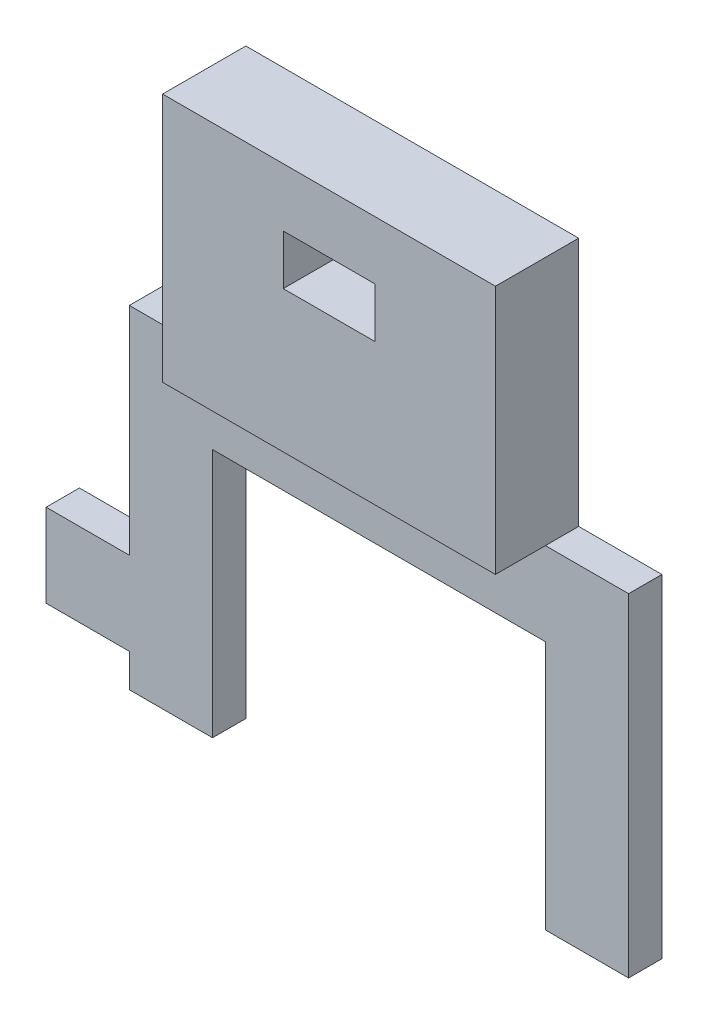
ISO-10303-21;
HEADER;
FILE_DESCRIPTION(('STEP AP214'),'2;1');
FILE_NAME('part.step','',(''),(''),'','','');
FILE_SCHEMA(('AUTOMOTIVE_DESIGN { 1 0 10303 214 1 1 1 1 }'));
ENDSEC;
DATA;
#1=APPLICATION_CONTEXT('core data for automotive mechanical design processes');
#2=APPLICATION_PROTOCOL_DEFINITION('international standard','automotive_design',2000,#1);
#3=PRODUCT_CONTEXT('',#1,'mechanical');
#4=PRODUCT('Part','Part','',(#3));
#5=PRODUCT_RELATED_PRODUCT_CATEGORY('part','',(#4));
#6=PRODUCT_DEFINITION_FORMATION('','',#4);
#7=PRODUCT_DEFINITION_CONTEXT('part definition',#1,'design');
#8=PRODUCT_DEFINITION('design','',#6,#7);
#9=PRODUCT_DEFINITION_SHAPE('','',#8);
#10=(LENGTH_UNIT() NAMED_UNIT(*) SI_UNIT(.MILLI.,.METRE.));
#11=(NAMED_UNIT(*) PLANE_ANGLE_UNIT() SI_UNIT($,.RADIAN.));
#12=(NAMED_UNIT(*) SI_UNIT($,.STERADIAN.) SOLID_ANGLE_UNIT());
#13=UNCERTAINTY_MEASURE_WITH_UNIT(LENGTH_MEASURE(1.E-05),#10,'distance_accuracy_value','');
#14=(GEOMETRIC_REPRESENTATION_CONTEXT(3) GLOBAL_UNCERTAINTY_ASSIGNED_CONTEXT((#13)) GLOBAL_UNIT_ASSIGNED_CONTEXT((#10,
#11,#12)) REPRESENTATION_CONTEXT('',''));
#15=CARTESIAN_POINT('',(0.,0.,0.));
#16=DIRECTION('',(0.,0.,1.));
#17=DIRECTION('',(1.,0.,0.));
#18=AXIS2_PLACEMENT_3D('',#15,#16,#17);
#19=CARTESIAN_POINT('',(35.,18.,2.));
#20=DIRECTION('',(0.,-1.,0.));
#21=DIRECTION('',(1.,0.,0.));
#22=AXIS2_PLACEMENT_3D('',#19,#20,#21);
#23=PLANE('',#22);
#24=DIRECTION('',(0.,0.,1.));
#25=VECTOR('',#24,1.);
#26=CARTESIAN_POINT('',(10.,18.,0.));
#27=LINE('',#26,#25);
#28=CARTESIAN_POINT('',(10.,18.,0.));
#29=VERTEX_POINT('',#28);
#30=CARTESIAN_POINT('',(10.,18.,2.));
#31=VERTEX_POINT('',#30);
#32=EDGE_CURVE('E185',#29,#31,#27,.T.);
#33=ORIENTED_EDGE('',*,*,#32,.F.);
#34=DIRECTION('',(-1.,0.,0.));
#35=VECTOR('',#34,1.);
#36=CARTESIAN_POINT('',(35.,18.,0.));
#37=LINE('',#36,#35);
#38=CARTESIAN_POINT('',(5.,18.,0.));
#39=VERTEX_POINT('',#38);
#40=EDGE_CURVE('E289',#29,#39,#37,.T.);
#41=ORIENTED_EDGE('',*,*,#40,.T.);
#42=DIRECTION('',(0.,0.,-1.));
#43=VECTOR('',#42,1.);
#44=CARTESIAN_POINT('',(5.,18.,2.));
#45=LINE('',#44,#43);
#46=CARTESIAN_POINT('',(5.,18.,2.));
#47=VERTEX_POINT('',#46);
#48=EDGE_CURVE('E300',#47,#39,#45,.T.);
#49=ORIENTED_EDGE('',*,*,#48,.F.);
#50=DIRECTION('',(-1.,0.,0.));
#51=VECTOR('',#50,1.);
#52=CARTESIAN_POINT('',(35.,18.,2.));
#53=LINE('',#52,#51);
#54=EDGE_CURVE('E262',#31,#47,#53,.T.);
#55=ORIENTED_EDGE('',*,*,#54,.F.);
#56=EDGE_LOOP('',(#33,#41,#49,#55));
#57=FACE_BOUND('',#56,.T.);
#58=ADVANCED_FACE('F33',(#57),#23,.F.);
#59=DIRECTION('',(0.,0.,-1.));
#60=VECTOR('',#59,1.);
#61=CARTESIAN_POINT('',(30.,18.,0.));
#62=LINE('',#61,#60);
#63=CARTESIAN_POINT('',(30.,18.,2.));
#64=VERTEX_POINT('',#63);
#65=CARTESIAN_POINT('',(30.,18.,0.));
#66=VERTEX_POINT('',#65);
#67=EDGE_CURVE('E227',#64,#66,#62,.T.);
#68=ORIENTED_EDGE('',*,*,#67,.F.);
#69=CARTESIAN_POINT('',(35.,18.,2.));
#70=VERTEX_POINT('',#69);
#71=EDGE_CURVE('E263',#70,#64,#53,.T.);
#72=ORIENTED_EDGE('',*,*,#71,.F.);
#73=DIRECTION('',(0.,0.,-1.));
#74=VECTOR('',#73,1.);
#75=CARTESIAN_POINT('',(35.,18.,2.));
#76=LINE('',#75,#74);
#77=CARTESIAN_POINT('',(35.,18.,0.));
#78=VERTEX_POINT('',#77);
#79=EDGE_CURVE('E303',#70,#78,#76,.T.);
#80=ORIENTED_EDGE('',*,*,#79,.T.);
#81=EDGE_CURVE('E290',#78,#66,#37,.T.);
#82=ORIENTED_EDGE('',*,*,#81,.T.);
#83=EDGE_LOOP('',(#68,#72,#80,#82));
#84=FACE_BOUND('',#83,.T.);
#85=ADVANCED_FACE('F353',(#84),#23,.F.);
#86=CARTESIAN_POINT('',(0.,5.,2.));
#87=DIRECTION('',(1.,0.,0.));
#88=DIRECTION('',(0.,0.,-1.));
#89=AXIS2_PLACEMENT_3D('',#86,#87,#88);
#90=PLANE('',#89);
#91=DIRECTION('',(0.,-1.,0.));
#92=VECTOR('',#91,1.);
#93=CARTESIAN_POINT('',(0.,5.,0.));
#94=LINE('',#93,#92);
#95=CARTESIAN_POINT('',(0.,5.,0.));
#96=VERTEX_POINT('',#95);
#97=CARTESIAN_POINT('',(0.,0.,0.));
#98=VERTEX_POINT('',#97);
#99=EDGE_CURVE('E241',#96,#98,#94,.T.);
#100=ORIENTED_EDGE('',*,*,#99,.T.);
#101=DIRECTION('',(0.,0.,-1.));
#102=VECTOR('',#101,1.);
#103=CARTESIAN_POINT('',(0.,0.,2.));
#104=LINE('',#103,#102);
#105=CARTESIAN_POINT('',(0.,0.,2.));
#106=VERTEX_POINT('',#105);
#107=EDGE_CURVE('E327',#106,#98,#104,.T.);
#108=ORIENTED_EDGE('',*,*,#107,.F.);
#109=DIRECTION('',(0.,-1.,0.));
#110=VECTOR('',#109,1.);
#111=CARTESIAN_POINT('',(0.,5.,2.));
#112=LINE('',#111,#110);
#113=CARTESIAN_POINT('',(0.,5.,2.));
#114=VERTEX_POINT('',#113);
#115=EDGE_CURVE('E242',#114,#106,#112,.T.);
#116=ORIENTED_EDGE('',*,*,#115,.F.);
#117=DIRECTION('',(0.,0.,-1.));
#118=VECTOR('',#117,1.);
#119=CARTESIAN_POINT('',(0.,5.,2.));
#120=LINE('',#119,#118);
#121=EDGE_CURVE('E269',#114,#96,#120,.T.);
#122=ORIENTED_EDGE('',*,*,#121,.T.);
#123=EDGE_LOOP('',(#100,#108,#116,#122));
#124=FACE_BOUND('',#123,.T.);
#125=ADVANCED_FACE('F35',(#124),#90,.F.);
#126=CARTESIAN_POINT('',(0.,0.,2.));
#127=DIRECTION('',(0.,1.,0.));
#128=DIRECTION('',(-1.,0.,0.));
#129=AXIS2_PLACEMENT_3D('',#126,#127,#128);
#130=PLANE('',#129);
#131=DIRECTION('',(1.,0.,0.));
#132=VECTOR('',#131,1.);
#133=CARTESIAN_POINT('',(0.,0.,0.));
#134=LINE('',#133,#132);
#135=CARTESIAN_POINT('',(5.,0.,0.));
#136=VERTEX_POINT('',#135);
#137=EDGE_CURVE('E272',#98,#136,#134,.T.);
#138=ORIENTED_EDGE('',*,*,#137,.T.);
#139=DIRECTION('',(0.,0.,-1.));
#140=VECTOR('',#139,1.);
#141=CARTESIAN_POINT('',(5.,0.,2.));
#142=LINE('',#141,#140);
#143=CARTESIAN_POINT('',(5.,0.,2.));
#144=VERTEX_POINT('',#143);
#145=EDGE_CURVE('E324',#144,#136,#142,.T.);
#146=ORIENTED_EDGE('',*,*,#145,.F.);
#147=DIRECTION('',(1.,0.,0.));
#148=VECTOR('',#147,1.);
#149=CARTESIAN_POINT('',(0.,0.,2.));
#150=LINE('',#149,#148);
#151=EDGE_CURVE('E245',#106,#144,#150,.T.);
#152=ORIENTED_EDGE('',*,*,#151,.F.);
#153=ORIENTED_EDGE('',*,*,#107,.T.);
#154=EDGE_LOOP('',(#138,#146,#152,#153));
#155=FACE_BOUND('',#154,.T.);
#156=ADVANCED_FACE('F392',(#155),#130,.F.);
#157=CARTESIAN_POINT('',(5.,0.,2.));
#158=DIRECTION('',(1.,0.,0.));
#159=DIRECTION('',(0.,0.,-1.));
#160=AXIS2_PLACEMENT_3D('',#157,#158,#159);
#161=PLANE('',#160);
#162=DIRECTION('',(0.,-1.,0.));
#163=VECTOR('',#162,1.);
#164=CARTESIAN_POINT('',(5.,0.,0.));
#165=LINE('',#164,#163);
#166=CARTESIAN_POINT('',(5.,-2.,0.));
#167=VERTEX_POINT('',#166);
#168=EDGE_CURVE('E274',#136,#167,#165,.T.);
#169=ORIENTED_EDGE('',*,*,#168,.T.);
#170=DIRECTION('',(0.,0.,-1.));
#171=VECTOR('',#170,1.);
#172=CARTESIAN_POINT('',(5.,-2.,2.));
#173=LINE('',#172,#171);
#174=CARTESIAN_POINT('',(5.,-2.,2.));
#175=VERTEX_POINT('',#174);
#176=EDGE_CURVE('E321',#175,#167,#173,.T.);
#177=ORIENTED_EDGE('',*,*,#176,.F.);
#178=DIRECTION('',(0.,-1.,0.));
#179=VECTOR('',#178,1.);
#180=CARTESIAN_POINT('',(5.,0.,2.));
#181=LINE('',#180,#179);
#182=EDGE_CURVE('E248',#144,#175,#181,.T.);
#183=ORIENTED_EDGE('',*,*,#182,.F.);
#184=ORIENTED_EDGE('',*,*,#145,.T.);
#185=EDGE_LOOP('',(#169,#177,#183,#184));
#186=FACE_BOUND('',#185,.T.);
#187=ADVANCED_FACE('F389',(#186),#161,.F.);
#188=CARTESIAN_POINT('',(5.,-2.,2.));
#189=DIRECTION('',(0.,1.,0.));
#190=DIRECTION('',(-1.,0.,0.));
#191=AXIS2_PLACEMENT_3D('',#188,#189,#190);
#192=PLANE('',#191);
#193=DIRECTION('',(1.,0.,0.));
#194=VECTOR('',#193,1.);
#195=CARTESIAN_POINT('',(5.,-2.,0.));
#196=LINE('',#195,#194);
#197=CARTESIAN_POINT('',(10.,-2.,0.));
#198=VERTEX_POINT('',#197);
#199=EDGE_CURVE('E276',#167,#198,#196,.T.);
#200=ORIENTED_EDGE('',*,*,#199,.T.);
#201=DIRECTION('',(0.,0.,-1.));
#202=VECTOR('',#201,1.);
#203=CARTESIAN_POINT('',(10.,-2.,2.));
#204=LINE('',#203,#202);
#205=CARTESIAN_POINT('',(10.,-2.,2.));
#206=VERTEX_POINT('',#205);
#207=EDGE_CURVE('E318',#206,#198,#204,.T.);
#208=ORIENTED_EDGE('',*,*,#207,.F.);
#209=DIRECTION('',(1.,0.,0.));
#210=VECTOR('',#209,1.);
#211=CARTESIAN_POINT('',(5.,-2.,2.));
#212=LINE('',#211,#210);
#213=EDGE_CURVE('E250',#175,#206,#212,.T.);
#214=ORIENTED_EDGE('',*,*,#213,.F.);
#215=ORIENTED_EDGE('',*,*,#176,.T.);
#216=EDGE_LOOP('',(#200,#208,#214,#215));
#217=FACE_BOUND('',#216,.T.);
#218=ADVANCED_FACE('F385',(#217),#192,.F.);
#219=CARTESIAN_POINT('',(10.,4.08247422680412,2.));
#220=DIRECTION('',(-1.,0.,0.));
#221=DIRECTION('',(0.,0.,1.));
#222=AXIS2_PLACEMENT_3D('',#219,#220,#221);
#223=PLANE('',#222);
#224=DIRECTION('',(0.,1.,0.));
#225=VECTOR('',#224,1.);
#226=CARTESIAN_POINT('',(10.,4.08247422680412,0.));
#227=LINE('',#226,#225);
#228=CARTESIAN_POINT('',(10.,13.,0.));
#229=VERTEX_POINT('',#228);
#230=EDGE_CURVE('E279',#198,#229,#227,.T.);
#231=ORIENTED_EDGE('',*,*,#230,.T.);
#232=DIRECTION('',(0.,0.,-1.));
#233=VECTOR('',#232,1.);
#234=CARTESIAN_POINT('',(10.,13.,2.));
#235=LINE('',#234,#233);
#236=CARTESIAN_POINT('',(10.,13.,2.));
#237=VERTEX_POINT('',#236);
#238=EDGE_CURVE('E315',#237,#229,#235,.T.);
#239=ORIENTED_EDGE('',*,*,#238,.F.);
#240=DIRECTION('',(0.,1.,0.));
#241=VECTOR('',#240,1.);
#242=CARTESIAN_POINT('',(10.,-2.,2.));
#243=LINE('',#242,#241);
#244=EDGE_CURVE('E252',#206,#237,#243,.T.);
#245=ORIENTED_EDGE('',*,*,#244,.F.);
#246=ORIENTED_EDGE('',*,*,#207,.T.);
#247=EDGE_LOOP('',(#231,#239,#245,#246));
#248=FACE_BOUND('',#247,.T.);
#249=ADVANCED_FACE('F381',(#248),#223,.F.);
#250=CARTESIAN_POINT('',(10.,13.,2.));
#251=DIRECTION('',(0.,1.,0.));
#252=DIRECTION('',(-1.,0.,0.));
#253=AXIS2_PLACEMENT_3D('',#250,#251,#252);
#254=PLANE('',#253);
#255=DIRECTION('',(1.,0.,0.));
#256=VECTOR('',#255,1.);
#257=CARTESIAN_POINT('',(10.,13.,0.));
#258=LINE('',#257,#256);
#259=CARTESIAN_POINT('',(30.,13.,0.));
#260=VERTEX_POINT('',#259);
#261=EDGE_CURVE('E281',#229,#260,#258,.T.);
#262=ORIENTED_EDGE('',*,*,#261,.T.);
#263=DIRECTION('',(0.,0.,-1.));
#264=VECTOR('',#263,1.);
#265=CARTESIAN_POINT('',(30.,13.,2.));
#266=LINE('',#265,#264);
#267=CARTESIAN_POINT('',(30.,13.,2.));
#268=VERTEX_POINT('',#267);
#269=EDGE_CURVE('E312',#268,#260,#266,.T.);
#270=ORIENTED_EDGE('',*,*,#269,.F.);
#271=DIRECTION('',(1.,0.,0.));
#272=VECTOR('',#271,1.);
#273=CARTESIAN_POINT('',(10.,13.,2.));
#274=LINE('',#273,#272);
#275=EDGE_CURVE('E254',#237,#268,#274,.T.);
#276=ORIENTED_EDGE('',*,*,#275,.F.);
#277=ORIENTED_EDGE('',*,*,#238,.T.);
#278=EDGE_LOOP('',(#262,#270,#276,#277));
#279=FACE_BOUND('',#278,.T.);
#280=ADVANCED_FACE('F377',(#279),#254,.F.);
#281=CARTESIAN_POINT('',(30.,13.,2.));
#282=DIRECTION('',(1.,0.,0.));
#283=DIRECTION('',(0.,0.,-1.));
#284=AXIS2_PLACEMENT_3D('',#281,#282,#283);
#285=PLANE('',#284);
#286=DIRECTION('',(0.,-1.,0.));
#287=VECTOR('',#286,1.);
#288=CARTESIAN_POINT('',(30.,13.,0.));
#289=LINE('',#288,#287);
#290=CARTESIAN_POINT('',(30.,-2.,0.));
#291=VERTEX_POINT('',#290);
#292=EDGE_CURVE('E283',#260,#291,#289,.T.);
#293=ORIENTED_EDGE('',*,*,#292,.T.);
#294=DIRECTION('',(0.,0.,-1.));
#295=VECTOR('',#294,1.);
#296=CARTESIAN_POINT('',(30.,-2.,2.));
#297=LINE('',#296,#295);
#298=CARTESIAN_POINT('',(30.,-2.,2.));
#299=VERTEX_POINT('',#298);
#300=EDGE_CURVE('E309',#299,#291,#297,.T.);
#301=ORIENTED_EDGE('',*,*,#300,.F.);
#302=DIRECTION('',(0.,-1.,0.));
#303=VECTOR('',#302,1.);
#304=CARTESIAN_POINT('',(30.,13.,2.));
#305=LINE('',#304,#303);
#306=EDGE_CURVE('E256',#268,#299,#305,.T.);
#307=ORIENTED_EDGE('',*,*,#306,.F.);
#308=ORIENTED_EDGE('',*,*,#269,.T.);
#309=EDGE_LOOP('',(#293,#301,#307,#308));
#310=FACE_BOUND('',#309,.T.);
#311=ADVANCED_FACE('F373',(#310),#285,.F.);
#312=CARTESIAN_POINT('',(30.,-2.,2.));
#313=DIRECTION('',(0.,1.,0.));
#314=DIRECTION('',(0.,0.,1.));
#315=AXIS2_PLACEMENT_3D('',#312,#313,#314);
#316=PLANE('',#315);
#317=DIRECTION('',(1.,0.,0.));
#318=VECTOR('',#317,1.);
#319=CARTESIAN_POINT('',(30.,-2.,0.));
#320=LINE('',#319,#318);
#321=CARTESIAN_POINT('',(35.,-2.,0.));
#322=VERTEX_POINT('',#321);
#323=EDGE_CURVE('E285',#291,#322,#320,.T.);
#324=ORIENTED_EDGE('',*,*,#323,.T.);
#325=DIRECTION('',(0.,0.,-1.));
#326=VECTOR('',#325,1.);
#327=CARTESIAN_POINT('',(35.,-2.,2.));
#328=LINE('',#327,#326);
#329=CARTESIAN_POINT('',(35.,-2.,2.));
#330=VERTEX_POINT('',#329);
#331=EDGE_CURVE('E306',#330,#322,#328,.T.);
#332=ORIENTED_EDGE('',*,*,#331,.F.);
#333=DIRECTION('',(1.,0.,0.));
#334=VECTOR('',#333,1.);
#335=CARTESIAN_POINT('',(30.,-2.,2.));
#336=LINE('',#335,#334);
#337=EDGE_CURVE('E258',#299,#330,#336,.T.);
#338=ORIENTED_EDGE('',*,*,#337,.F.);
#339=ORIENTED_EDGE('',*,*,#300,.T.);
#340=EDGE_LOOP('',(#324,#332,#338,#339));
#341=FACE_BOUND('',#340,.T.);
#342=ADVANCED_FACE('F369',(#341),#316,.F.);
#343=CARTESIAN_POINT('',(35.,-2.,2.));
#344=DIRECTION('',(-1.,0.,0.));
#345=DIRECTION('',(0.,0.,1.));
#346=AXIS2_PLACEMENT_3D('',#343,#344,#345);
#347=PLANE('',#346);
#348=DIRECTION('',(0.,1.,0.));
#349=VECTOR('',#348,1.);
#350=CARTESIAN_POINT('',(35.,-2.,0.));
#351=LINE('',#350,#349);
#352=EDGE_CURVE('E287',#322,#78,#351,.T.);
#353=ORIENTED_EDGE('',*,*,#352,.T.);
#354=ORIENTED_EDGE('',*,*,#79,.F.);
#355=DIRECTION('',(0.,1.,0.));
#356=VECTOR('',#355,1.);
#357=CARTESIAN_POINT('',(35.,-2.,2.));
#358=LINE('',#357,#356);
#359=EDGE_CURVE('E260',#330,#70,#358,.T.);
#360=ORIENTED_EDGE('',*,*,#359,.F.);
#361=ORIENTED_EDGE('',*,*,#331,.T.);
#362=EDGE_LOOP('',(#353,#354,#360,#361));
#363=FACE_BOUND('',#362,.T.);
#364=ADVANCED_FACE('F366',(#363),#347,.F.);
#365=CARTESIAN_POINT('',(5.,18.,2.));
#366=DIRECTION('',(1.,0.,0.));
#367=DIRECTION('',(0.,1.,0.));
#368=AXIS2_PLACEMENT_3D('',#365,#366,#367);
#369=PLANE('',#368);
#370=DIRECTION('',(0.,-1.,0.));
#371=VECTOR('',#370,1.);
#372=CARTESIAN_POINT('',(5.,18.,0.));
#373=LINE('',#372,#371);
#374=CARTESIAN_POINT('',(5.,5.,0.));
#375=VERTEX_POINT('',#374);
#376=EDGE_CURVE('E292',#39,#375,#373,.T.);
#377=ORIENTED_EDGE('',*,*,#376,.T.);
#378=DIRECTION('',(0.,0.,-1.));
#379=VECTOR('',#378,1.);
#380=CARTESIAN_POINT('',(5.,5.,2.));
#381=LINE('',#380,#379);
#382=CARTESIAN_POINT('',(5.,5.,2.));
#383=VERTEX_POINT('',#382);
#384=EDGE_CURVE('E297',#383,#375,#381,.T.);
#385=ORIENTED_EDGE('',*,*,#384,.F.);
#386=DIRECTION('',(0.,-1.,0.));
#387=VECTOR('',#386,1.);
#388=CARTESIAN_POINT('',(5.,18.,2.));
#389=LINE('',#388,#387);
#390=EDGE_CURVE('E265',#47,#383,#389,.T.);
#391=ORIENTED_EDGE('',*,*,#390,.F.);
#392=ORIENTED_EDGE('',*,*,#48,.T.);
#393=EDGE_LOOP('',(#377,#385,#391,#392));
#394=FACE_BOUND('',#393,.T.);
#395=ADVANCED_FACE('F364',(#394),#369,.F.);
#396=CARTESIAN_POINT('',(5.,5.,2.));
#397=DIRECTION('',(0.,-1.,0.));
#398=DIRECTION('',(0.,0.,-1.));
#399=AXIS2_PLACEMENT_3D('',#396,#397,#398);
#400=PLANE('',#399);
#401=DIRECTION('',(-1.,0.,0.));
#402=VECTOR('',#401,1.);
#403=CARTESIAN_POINT('',(5.,5.,0.));
#404=LINE('',#403,#402);
#405=EDGE_CURVE('E246',#375,#96,#404,.T.);
#406=ORIENTED_EDGE('',*,*,#405,.T.);
#407=ORIENTED_EDGE('',*,*,#121,.F.);
#408=DIRECTION('',(-1.,0.,0.));
#409=VECTOR('',#408,1.);
#410=CARTESIAN_POINT('',(5.,5.,2.));
#411=LINE('',#410,#409);
#412=EDGE_CURVE('E267',#383,#114,#411,.T.);
#413=ORIENTED_EDGE('',*,*,#412,.F.);
#414=ORIENTED_EDGE('',*,*,#384,.T.);
#415=EDGE_LOOP('',(#406,#407,#413,#414));
#416=FACE_BOUND('',#415,.T.);
#417=ADVANCED_FACE('F422',(#416),#400,.F.);
#418=CARTESIAN_POINT('',(0.,0.,2.));
#419=DIRECTION('',(0.,0.,1.));
#420=DIRECTION('',(1.,0.,0.));
#421=AXIS2_PLACEMENT_3D('',#418,#419,#420);
#422=PLANE('',#421);
#423=DIRECTION('',(1.,0.,0.));
#424=VECTOR('',#423,1.);
#425=CARTESIAN_POINT('',(10.,18.,2.));
#426=LINE('',#425,#424);
#427=EDGE_CURVE('E56',#31,#64,#426,.T.);
#428=ORIENTED_EDGE('',*,*,#427,.F.);
#429=ORIENTED_EDGE('',*,*,#54,.T.);
#430=ORIENTED_EDGE('',*,*,#390,.T.);
#431=ORIENTED_EDGE('',*,*,#412,.T.);
#432=ORIENTED_EDGE('',*,*,#115,.T.);
#433=ORIENTED_EDGE('',*,*,#151,.T.);
#434=ORIENTED_EDGE('',*,*,#182,.T.);
#435=ORIENTED_EDGE('',*,*,#213,.T.);
#436=ORIENTED_EDGE('',*,*,#244,.T.);
#437=ORIENTED_EDGE('',*,*,#275,.T.);
#438=ORIENTED_EDGE('',*,*,#306,.T.);
#439=ORIENTED_EDGE('',*,*,#337,.T.);
#440=ORIENTED_EDGE('',*,*,#359,.T.);
#441=ORIENTED_EDGE('',*,*,#71,.T.);
#442=EDGE_LOOP('',(#428,#429,#430,#431,#432,#433,#434,#435,#436,#437,#438,#439,#440,#441));
#443=FACE_BOUND('',#442,.T.);
#444=ADVANCED_FACE('F413',(#443),#422,.T.);
#445=CARTESIAN_POINT('',(0.,0.,0.));
#446=DIRECTION('',(0.,0.,1.));
#447=DIRECTION('',(1.,0.,0.));
#448=AXIS2_PLACEMENT_3D('',#445,#446,#447);
#449=PLANE('',#448);
#450=DIRECTION('',(-1.,0.,0.));
#451=VECTOR('',#450,1.);
#452=CARTESIAN_POINT('',(0.,29.5,0.));
#453=LINE('',#452,#451);
#454=CARTESIAN_POINT('',(22.75,29.5,0.));
#455=VERTEX_POINT('',#454);
#456=CARTESIAN_POINT('',(17.25,29.5,0.));
#457=VERTEX_POINT('',#456);
#458=EDGE_CURVE('E41',#455,#457,#453,.T.);
#459=ORIENTED_EDGE('',*,*,#458,.T.);
#460=DIRECTION('',(0.,-1.,0.));
#461=VECTOR('',#460,1.);
#462=CARTESIAN_POINT('',(17.25,0.,0.));
#463=LINE('',#462,#461);
#464=CARTESIAN_POINT('',(17.25,26.5,0.));
#465=VERTEX_POINT('',#464);
#466=EDGE_CURVE('E11',#457,#465,#463,.T.);
#467=ORIENTED_EDGE('',*,*,#466,.T.);
#468=DIRECTION('',(1.,0.,0.));
#469=VECTOR('',#468,1.);
#470=CARTESIAN_POINT('',(0.,26.5,0.));
#471=LINE('',#470,#469);
#472=CARTESIAN_POINT('',(22.75,26.5,0.));
#473=VERTEX_POINT('',#472);
#474=EDGE_CURVE('E330',#465,#473,#471,.T.);
#475=ORIENTED_EDGE('',*,*,#474,.T.);
#476=DIRECTION('',(0.,1.,0.));
#477=VECTOR('',#476,1.);
#478=CARTESIAN_POINT('',(22.75,0.,0.));
#479=LINE('',#478,#477);
#480=EDGE_CURVE('E333',#473,#455,#479,.T.);
#481=ORIENTED_EDGE('',*,*,#480,.T.);
#482=EDGE_LOOP('',(#459,#467,#475,#481));
#483=FACE_BOUND('',#482,.T.);
#484=ORIENTED_EDGE('',*,*,#99,.F.);
#485=ORIENTED_EDGE('',*,*,#405,.F.);
#486=ORIENTED_EDGE('',*,*,#376,.F.);
#487=ORIENTED_EDGE('',*,*,#40,.F.);
#488=DIRECTION('',(0.,-1.,0.));
#489=VECTOR('',#488,1.);
#490=CARTESIAN_POINT('',(10.,33.,0.));
#491=LINE('',#490,#489);
#492=CARTESIAN_POINT('',(10.,33.,0.));
#493=VERTEX_POINT('',#492);
#494=EDGE_CURVE('E231',#493,#29,#491,.T.);
#495=ORIENTED_EDGE('',*,*,#494,.F.);
#496=DIRECTION('',(-1.,0.,0.));
#497=VECTOR('',#496,1.);
#498=CARTESIAN_POINT('',(10.,33.,0.));
#499=LINE('',#498,#497);
#500=CARTESIAN_POINT('',(30.,33.,0.));
#501=VERTEX_POINT('',#500);
#502=EDGE_CURVE('E229',#501,#493,#499,.T.);
#503=ORIENTED_EDGE('',*,*,#502,.F.);
#504=DIRECTION('',(0.,-1.,0.));
#505=VECTOR('',#504,1.);
#506=CARTESIAN_POINT('',(30.,33.,0.));
#507=LINE('',#506,#505);
#508=EDGE_CURVE('E238',#501,#66,#507,.T.);
#509=ORIENTED_EDGE('',*,*,#508,.T.);
#510=ORIENTED_EDGE('',*,*,#81,.F.);
#511=ORIENTED_EDGE('',*,*,#352,.F.);
#512=ORIENTED_EDGE('',*,*,#323,.F.);
#513=ORIENTED_EDGE('',*,*,#292,.F.);
#514=ORIENTED_EDGE('',*,*,#261,.F.);
#515=ORIENTED_EDGE('',*,*,#230,.F.);
#516=ORIENTED_EDGE('',*,*,#199,.F.);
#517=ORIENTED_EDGE('',*,*,#168,.F.);
#518=ORIENTED_EDGE('',*,*,#137,.F.);
#519=EDGE_LOOP('',(#484,#485,#486,#487,#495,#503,#509,#510,#511,#512,#513,#514,#515,#516,#517,#518));
#520=FACE_BOUND('',#519,.T.);
#521=ADVANCED_FACE('F336',(#483,#520),#449,.F.);
#522=CARTESIAN_POINT('',(10.,33.,0.));
#523=DIRECTION('',(1.,0.,0.));
#524=DIRECTION('',(0.,1.,0.));
#525=AXIS2_PLACEMENT_3D('',#522,#523,#524);
#526=PLANE('',#525);
#527=ORIENTED_EDGE('',*,*,#32,.T.);
#528=DIRECTION('',(0.,0.,-1.));
#529=VECTOR('',#528,1.);
#530=CARTESIAN_POINT('',(10.,18.,5.));
#531=LINE('',#530,#529);
#532=CARTESIAN_POINT('',(10.,18.,5.));
#533=VERTEX_POINT('',#532);
#534=EDGE_CURVE('E217',#533,#31,#531,.T.);
#535=ORIENTED_EDGE('',*,*,#534,.F.);
#536=DIRECTION('',(0.,-1.,0.));
#537=VECTOR('',#536,1.);
#538=CARTESIAN_POINT('',(10.,33.,5.));
#539=LINE('',#538,#537);
#540=CARTESIAN_POINT('',(10.,33.,5.));
#541=VERTEX_POINT('',#540);
#542=EDGE_CURVE('E206',#541,#533,#539,.T.);
#543=ORIENTED_EDGE('',*,*,#542,.F.);
#544=DIRECTION('',(0.,0.,1.));
#545=VECTOR('',#544,1.);
#546=CARTESIAN_POINT('',(10.,33.,0.));
#547=LINE('',#546,#545);
#548=EDGE_CURVE('E224',#493,#541,#547,.T.);
#549=ORIENTED_EDGE('',*,*,#548,.F.);
#550=ORIENTED_EDGE('',*,*,#494,.T.);
#551=EDGE_LOOP('',(#527,#535,#543,#549,#550));
#552=FACE_BOUND('',#551,.T.);
#553=ADVANCED_FACE('F431',(#552),#526,.F.);
#554=CARTESIAN_POINT('',(30.,33.,0.));
#555=DIRECTION('',(-1.,0.,0.));
#556=DIRECTION('',(0.,-1.,0.));
#557=AXIS2_PLACEMENT_3D('',#554,#555,#556);
#558=PLANE('',#557);
#559=ORIENTED_EDGE('',*,*,#67,.T.);
#560=ORIENTED_EDGE('',*,*,#508,.F.);
#561=DIRECTION('',(0.,0.,-1.));
#562=VECTOR('',#561,1.);
#563=CARTESIAN_POINT('',(30.,33.,0.));
#564=LINE('',#563,#562);
#565=CARTESIAN_POINT('',(30.,33.,5.));
#566=VERTEX_POINT('',#565);
#567=EDGE_CURVE('E226',#566,#501,#564,.T.);
#568=ORIENTED_EDGE('',*,*,#567,.F.);
#569=DIRECTION('',(0.,1.,0.));
#570=VECTOR('',#569,1.);
#571=CARTESIAN_POINT('',(30.,18.,5.));
#572=LINE('',#571,#570);
#573=CARTESIAN_POINT('',(30.,18.,5.));
#574=VERTEX_POINT('',#573);
#575=EDGE_CURVE('E210',#574,#566,#572,.T.);
#576=ORIENTED_EDGE('',*,*,#575,.F.);
#577=DIRECTION('',(0.,0.,-1.));
#578=VECTOR('',#577,1.);
#579=CARTESIAN_POINT('',(30.,18.,5.));
#580=LINE('',#579,#578);
#581=EDGE_CURVE('E213',#574,#64,#580,.T.);
#582=ORIENTED_EDGE('',*,*,#581,.T.);
#583=EDGE_LOOP('',(#559,#560,#568,#576,#582));
#584=FACE_BOUND('',#583,.T.);
#585=ADVANCED_FACE('F441',(#584),#558,.F.);
#586=CARTESIAN_POINT('',(0.,33.,0.));
#587=DIRECTION('',(0.,1.,0.));
#588=DIRECTION('',(-1.,0.,0.));
#589=AXIS2_PLACEMENT_3D('',#586,#587,#588);
#590=PLANE('',#589);
#591=ORIENTED_EDGE('',*,*,#548,.T.);
#592=DIRECTION('',(-1.,0.,0.));
#593=VECTOR('',#592,1.);
#594=CARTESIAN_POINT('',(30.,33.,5.));
#595=LINE('',#594,#593);
#596=EDGE_CURVE('E203',#566,#541,#595,.T.);
#597=ORIENTED_EDGE('',*,*,#596,.F.);
#598=ORIENTED_EDGE('',*,*,#567,.T.);
#599=ORIENTED_EDGE('',*,*,#502,.T.);
#600=EDGE_LOOP('',(#591,#597,#598,#599));
#601=FACE_BOUND('',#600,.T.);
#602=ADVANCED_FACE('F436',(#601),#590,.T.);
#603=CARTESIAN_POINT('',(17.25,29.5,-13.));
#604=DIRECTION('',(-1.,0.,0.));
#605=DIRECTION('',(0.,0.,1.));
#606=AXIS2_PLACEMENT_3D('',#603,#604,#605);
#607=PLANE('',#606);
#608=DIRECTION('',(0.,0.,1.));
#609=VECTOR('',#608,1.);
#610=CARTESIAN_POINT('',(17.25,29.5,-13.));
#611=LINE('',#610,#609);
#612=CARTESIAN_POINT('',(17.25,29.5,5.));
#613=VERTEX_POINT('',#612);
#614=EDGE_CURVE('E176',#457,#613,#611,.T.);
#615=ORIENTED_EDGE('',*,*,#614,.T.);
#616=DIRECTION('',(0.,-1.,0.));
#617=VECTOR('',#616,1.);
#618=CARTESIAN_POINT('',(17.25,29.5,5.));
#619=LINE('',#618,#617);
#620=CARTESIAN_POINT('',(17.25,26.5,5.));
#621=VERTEX_POINT('',#620);
#622=EDGE_CURVE('E181',#613,#621,#619,.T.);
#623=ORIENTED_EDGE('',*,*,#622,.T.);
#624=DIRECTION('',(0.,0.,1.));
#625=VECTOR('',#624,1.);
#626=CARTESIAN_POINT('',(17.25,26.5,-13.));
#627=LINE('',#626,#625);
#628=EDGE_CURVE('E219',#465,#621,#627,.T.);
#629=ORIENTED_EDGE('',*,*,#628,.F.);
#630=ORIENTED_EDGE('',*,*,#466,.F.);
#631=EDGE_LOOP('',(#615,#623,#629,#630));
#632=FACE_BOUND('',#631,.T.);
#633=ADVANCED_FACE('F178',(#632),#607,.F.);
#634=CARTESIAN_POINT('',(17.25,29.5,-13.));
#635=DIRECTION('',(0.,1.,0.));
#636=DIRECTION('',(-1.,0.,0.));
#637=AXIS2_PLACEMENT_3D('',#634,#635,#636);
#638=PLANE('',#637);
#639=DIRECTION('',(0.,0.,1.));
#640=VECTOR('',#639,1.);
#641=CARTESIAN_POINT('',(22.75,29.5,-13.));
#642=LINE('',#641,#640);
#643=CARTESIAN_POINT('',(22.75,29.5,5.));
#644=VERTEX_POINT('',#643);
#645=EDGE_CURVE('E186',#455,#644,#642,.T.);
#646=ORIENTED_EDGE('',*,*,#645,.T.);
#647=DIRECTION('',(-1.,0.,0.));
#648=VECTOR('',#647,1.);
#649=CARTESIAN_POINT('',(22.75,29.5,5.));
#650=LINE('',#649,#648);
#651=EDGE_CURVE('E189',#644,#613,#650,.T.);
#652=ORIENTED_EDGE('',*,*,#651,.T.);
#653=ORIENTED_EDGE('',*,*,#614,.F.);
#654=ORIENTED_EDGE('',*,*,#458,.F.);
#655=EDGE_LOOP('',(#646,#652,#653,#654));
#656=FACE_BOUND('',#655,.T.);
#657=ADVANCED_FACE('F190',(#656),#638,.F.);
#658=CARTESIAN_POINT('',(22.75,29.5,-13.));
#659=DIRECTION('',(1.,0.,0.));
#660=DIRECTION('',(0.,0.,-1.));
#661=AXIS2_PLACEMENT_3D('',#658,#659,#660);
#662=PLANE('',#661);
#663=DIRECTION('',(0.,0.,1.));
#664=VECTOR('',#663,1.);
#665=CARTESIAN_POINT('',(22.75,26.5,-13.));
#666=LINE('',#665,#664);
#667=CARTESIAN_POINT('',(22.75,26.5,5.));
#668=VERTEX_POINT('',#667);
#669=EDGE_CURVE('E48',#473,#668,#666,.T.);
#670=ORIENTED_EDGE('',*,*,#669,.T.);
#671=DIRECTION('',(0.,1.,0.));
#672=VECTOR('',#671,1.);
#673=CARTESIAN_POINT('',(22.75,26.5,5.));
#674=LINE('',#673,#672);
#675=EDGE_CURVE('E199',#668,#644,#674,.T.);
#676=ORIENTED_EDGE('',*,*,#675,.T.);
#677=ORIENTED_EDGE('',*,*,#645,.F.);
#678=ORIENTED_EDGE('',*,*,#480,.F.);
#679=EDGE_LOOP('',(#670,#676,#677,#678));
#680=FACE_BOUND('',#679,.T.);
#681=ADVANCED_FACE('F339',(#680),#662,.F.);
#682=CARTESIAN_POINT('',(17.25,26.5,-13.));
#683=DIRECTION('',(0.,-1.,0.));
#684=DIRECTION('',(0.,0.,-1.));
#685=AXIS2_PLACEMENT_3D('',#682,#683,#684);
#686=PLANE('',#685);
#687=ORIENTED_EDGE('',*,*,#628,.T.);
#688=DIRECTION('',(1.,0.,0.));
#689=VECTOR('',#688,1.);
#690=CARTESIAN_POINT('',(17.25,26.5,5.));
#691=LINE('',#690,#689);
#692=EDGE_CURVE('E197',#621,#668,#691,.T.);
#693=ORIENTED_EDGE('',*,*,#692,.T.);
#694=ORIENTED_EDGE('',*,*,#669,.F.);
#695=ORIENTED_EDGE('',*,*,#474,.F.);
#696=EDGE_LOOP('',(#687,#693,#694,#695));
#697=FACE_BOUND('',#696,.T.);
#698=ADVANCED_FACE('F340',(#697),#686,.F.);
#699=CARTESIAN_POINT('',(0.,0.,5.));
#700=DIRECTION('',(0.,0.,1.));
#701=DIRECTION('',(1.,0.,0.));
#702=AXIS2_PLACEMENT_3D('',#699,#700,#701);
#703=PLANE('',#702);
#704=ORIENTED_EDGE('',*,*,#596,.T.);
#705=ORIENTED_EDGE('',*,*,#542,.T.);
#706=DIRECTION('',(1.,0.,0.));
#707=VECTOR('',#706,1.);
#708=CARTESIAN_POINT('',(10.,18.,5.));
#709=LINE('',#708,#707);
#710=EDGE_CURVE('E208',#533,#574,#709,.T.);
#711=ORIENTED_EDGE('',*,*,#710,.T.);
#712=ORIENTED_EDGE('',*,*,#575,.T.);
#713=EDGE_LOOP('',(#704,#705,#711,#712));
#714=FACE_BOUND('',#713,.T.);
#715=ORIENTED_EDGE('',*,*,#622,.F.);
#716=ORIENTED_EDGE('',*,*,#651,.F.);
#717=ORIENTED_EDGE('',*,*,#675,.F.);
#718=ORIENTED_EDGE('',*,*,#692,.F.);
#719=EDGE_LOOP('',(#715,#716,#717,#718));
#720=FACE_BOUND('',#719,.T.);
#721=ADVANCED_FACE('F196',(#714,#720),#703,.T.);
#722=CARTESIAN_POINT('',(10.,18.,5.));
#723=DIRECTION('',(0.,1.,0.));
#724=DIRECTION('',(-1.,0.,0.));
#725=AXIS2_PLACEMENT_3D('',#722,#723,#724);
#726=PLANE('',#725);
#727=ORIENTED_EDGE('',*,*,#427,.T.);
#728=ORIENTED_EDGE('',*,*,#581,.F.);
#729=ORIENTED_EDGE('',*,*,#710,.F.);
#730=ORIENTED_EDGE('',*,*,#534,.T.);
#731=EDGE_LOOP('',(#727,#728,#729,#730));
#732=FACE_BOUND('',#731,.T.);
#733=ADVANCED_FACE('F347',(#732),#726,.F.);
#734=CLOSED_SHELL('',(#58,#85,#125,#156,#187,#218,#249,#280,#311,#342,#364,#395,#417,#444,#521,
#553,#585,#602,#633,#657,#681,#698,#721,#733));
#735=MANIFOLD_SOLID_BREP('B2',#734);
#736=ADVANCED_BREP_SHAPE_REPRESENTATION('',(#18,#735),#14);
#737=SHAPE_DEFINITION_REPRESENTATION(#9,#736);
ENDSEC;
END-ISO-10303-21;
